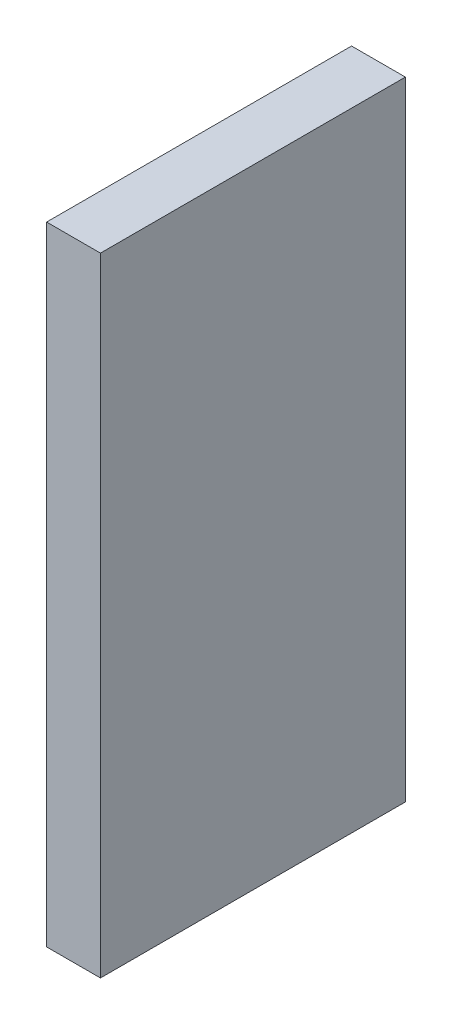
ISO-10303-21;
HEADER;
FILE_DESCRIPTION(('STEP AP214'),'2;1');
FILE_NAME('part.step','',(''),(''),'','','');
FILE_SCHEMA(('AUTOMOTIVE_DESIGN { 1 0 10303 214 1 1 1 1 }'));
ENDSEC;
DATA;
#1=APPLICATION_CONTEXT('core data for automotive mechanical design processes');
#2=APPLICATION_PROTOCOL_DEFINITION('international standard','automotive_design',2000,#1);
#3=PRODUCT_CONTEXT('',#1,'mechanical');
#4=PRODUCT('Part','Part','',(#3));
#5=PRODUCT_RELATED_PRODUCT_CATEGORY('part','',(#4));
#6=PRODUCT_DEFINITION_FORMATION('','',#4);
#7=PRODUCT_DEFINITION_CONTEXT('part definition',#1,'design');
#8=PRODUCT_DEFINITION('design','',#6,#7);
#9=PRODUCT_DEFINITION_SHAPE('','',#8);
#10=(LENGTH_UNIT() NAMED_UNIT(*) SI_UNIT(.MILLI.,.METRE.));
#11=(NAMED_UNIT(*) PLANE_ANGLE_UNIT() SI_UNIT($,.RADIAN.));
#12=(NAMED_UNIT(*) SI_UNIT($,.STERADIAN.) SOLID_ANGLE_UNIT());
#13=UNCERTAINTY_MEASURE_WITH_UNIT(LENGTH_MEASURE(1.E-05),#10,'distance_accuracy_value','');
#14=(GEOMETRIC_REPRESENTATION_CONTEXT(3) GLOBAL_UNCERTAINTY_ASSIGNED_CONTEXT((#13)) GLOBAL_UNIT_ASSIGNED_CONTEXT((#10,
#11,#12)) REPRESENTATION_CONTEXT('',''));
#15=CARTESIAN_POINT('',(0.,0.,0.));
#16=DIRECTION('',(0.,0.,1.));
#17=DIRECTION('',(1.,0.,0.));
#18=AXIS2_PLACEMENT_3D('',#15,#16,#17);
#19=CARTESIAN_POINT('',(4.77028330888016,0.,17.));
#20=DIRECTION('',(-1.,0.,0.));
#21=DIRECTION('',(0.,0.,1.));
#22=AXIS2_PLACEMENT_3D('',#19,#20,#21);
#23=PLANE('',#22);
#24=DIRECTION('',(0.,1.,0.));
#25=VECTOR('',#24,1.);
#26=CARTESIAN_POINT('',(4.77028330888016,0.,0.));
#27=LINE('',#26,#25);
#28=CARTESIAN_POINT('',(4.77028330888016,22.311583721781,0.));
#29=VERTEX_POINT('',#28);
#30=CARTESIAN_POINT('',(4.77028330888016,57.3115837217811,0.));
#31=VERTEX_POINT('',#30);
#32=EDGE_CURVE('E98',#29,#31,#27,.T.);
#33=ORIENTED_EDGE('',*,*,#32,.F.);
#34=DIRECTION('',(0.,0.,-1.));
#35=VECTOR('',#34,1.);
#36=CARTESIAN_POINT('',(4.77028330888016,22.311583721781,17.));
#37=LINE('',#36,#35);
#38=CARTESIAN_POINT('',(4.77028330888016,22.311583721781,17.));
#39=VERTEX_POINT('',#38);
#40=EDGE_CURVE('E11',#39,#29,#37,.T.);
#41=ORIENTED_EDGE('',*,*,#40,.F.);
#42=DIRECTION('',(0.,1.,0.));
#43=VECTOR('',#42,1.);
#44=CARTESIAN_POINT('',(4.77028330888016,0.,17.));
#45=LINE('',#44,#43);
#46=CARTESIAN_POINT('',(4.77028330888016,57.3115837217811,17.));
#47=VERTEX_POINT('',#46);
#48=EDGE_CURVE('E92',#39,#47,#45,.T.);
#49=ORIENTED_EDGE('',*,*,#48,.T.);
#50=DIRECTION('',(0.,0.,-1.));
#51=VECTOR('',#50,1.);
#52=CARTESIAN_POINT('',(4.77028330888016,57.3115837217811,17.));
#53=LINE('',#52,#51);
#54=EDGE_CURVE('E73',#47,#31,#53,.T.);
#55=ORIENTED_EDGE('',*,*,#54,.T.);
#56=EDGE_LOOP('',(#33,#41,#49,#55));
#57=FACE_BOUND('',#56,.T.);
#58=ADVANCED_FACE('F35',(#57),#23,.T.);
#59=CARTESIAN_POINT('',(0.,22.311583721781,17.));
#60=DIRECTION('',(0.,-1.,0.));
#61=DIRECTION('',(0.,0.,-1.));
#62=AXIS2_PLACEMENT_3D('',#59,#60,#61);
#63=PLANE('',#62);
#64=DIRECTION('',(-1.,0.,0.));
#65=VECTOR('',#64,1.);
#66=CARTESIAN_POINT('',(0.,22.311583721781,0.));
#67=LINE('',#66,#65);
#68=CARTESIAN_POINT('',(7.77028330888016,22.311583721781,0.));
#69=VERTEX_POINT('',#68);
#70=EDGE_CURVE('E86',#69,#29,#67,.T.);
#71=ORIENTED_EDGE('',*,*,#70,.F.);
#72=DIRECTION('',(0.,0.,-1.));
#73=VECTOR('',#72,1.);
#74=CARTESIAN_POINT('',(7.77028330888016,22.311583721781,17.));
#75=LINE('',#74,#73);
#76=CARTESIAN_POINT('',(7.77028330888016,22.311583721781,17.));
#77=VERTEX_POINT('',#76);
#78=EDGE_CURVE('E43',#77,#69,#75,.T.);
#79=ORIENTED_EDGE('',*,*,#78,.F.);
#80=DIRECTION('',(-1.,0.,0.));
#81=VECTOR('',#80,1.);
#82=CARTESIAN_POINT('',(0.,22.311583721781,17.));
#83=LINE('',#82,#81);
#84=EDGE_CURVE('E84',#77,#39,#83,.T.);
#85=ORIENTED_EDGE('',*,*,#84,.T.);
#86=ORIENTED_EDGE('',*,*,#40,.T.);
#87=EDGE_LOOP('',(#71,#79,#85,#86));
#88=FACE_BOUND('',#87,.T.);
#89=ADVANCED_FACE('F82',(#88),#63,.T.);
#90=CARTESIAN_POINT('',(7.77028330888017,0.,17.));
#91=DIRECTION('',(-1.,0.,0.));
#92=DIRECTION('',(0.,-1.,0.));
#93=AXIS2_PLACEMENT_3D('',#90,#91,#92);
#94=PLANE('',#93);
#95=DIRECTION('',(0.,1.,0.));
#96=VECTOR('',#95,1.);
#97=CARTESIAN_POINT('',(7.77028330888017,0.,0.));
#98=LINE('',#97,#96);
#99=CARTESIAN_POINT('',(7.77028330888016,57.3115837217811,0.));
#100=VERTEX_POINT('',#99);
#101=EDGE_CURVE('E66',#69,#100,#98,.T.);
#102=ORIENTED_EDGE('',*,*,#101,.T.);
#103=DIRECTION('',(0.,0.,-1.));
#104=VECTOR('',#103,1.);
#105=CARTESIAN_POINT('',(7.77028330888016,57.3115837217811,17.));
#106=LINE('',#105,#104);
#107=CARTESIAN_POINT('',(7.77028330888016,57.3115837217811,17.));
#108=VERTEX_POINT('',#107);
#109=EDGE_CURVE('E87',#108,#100,#106,.T.);
#110=ORIENTED_EDGE('',*,*,#109,.F.);
#111=DIRECTION('',(0.,1.,0.));
#112=VECTOR('',#111,1.);
#113=CARTESIAN_POINT('',(7.77028330888017,0.,17.));
#114=LINE('',#113,#112);
#115=EDGE_CURVE('E88',#77,#108,#114,.T.);
#116=ORIENTED_EDGE('',*,*,#115,.F.);
#117=ORIENTED_EDGE('',*,*,#78,.T.);
#118=EDGE_LOOP('',(#102,#110,#116,#117));
#119=FACE_BOUND('',#118,.T.);
#120=ADVANCED_FACE('F89',(#119),#94,.F.);
#121=CARTESIAN_POINT('',(0.,57.3115837217811,17.));
#122=DIRECTION('',(0.,-1.,0.));
#123=DIRECTION('',(0.,0.,-1.));
#124=AXIS2_PLACEMENT_3D('',#121,#122,#123);
#125=PLANE('',#124);
#126=DIRECTION('',(-1.,0.,0.));
#127=VECTOR('',#126,1.);
#128=CARTESIAN_POINT('',(0.,57.3115837217811,0.));
#129=LINE('',#128,#127);
#130=EDGE_CURVE('E94',#100,#31,#129,.T.);
#131=ORIENTED_EDGE('',*,*,#130,.T.);
#132=ORIENTED_EDGE('',*,*,#54,.F.);
#133=DIRECTION('',(-1.,0.,0.));
#134=VECTOR('',#133,1.);
#135=CARTESIAN_POINT('',(0.,57.3115837217811,17.));
#136=LINE('',#135,#134);
#137=EDGE_CURVE('E51',#108,#47,#136,.T.);
#138=ORIENTED_EDGE('',*,*,#137,.F.);
#139=ORIENTED_EDGE('',*,*,#109,.T.);
#140=EDGE_LOOP('',(#131,#132,#138,#139));
#141=FACE_BOUND('',#140,.T.);
#142=ADVANCED_FACE('F107',(#141),#125,.F.);
#143=CARTESIAN_POINT('',(0.,0.,17.));
#144=DIRECTION('',(0.,0.,1.));
#145=DIRECTION('',(1.,0.,0.));
#146=AXIS2_PLACEMENT_3D('',#143,#144,#145);
#147=PLANE('',#146);
#148=ORIENTED_EDGE('',*,*,#48,.F.);
#149=ORIENTED_EDGE('',*,*,#84,.F.);
#150=ORIENTED_EDGE('',*,*,#115,.T.);
#151=ORIENTED_EDGE('',*,*,#137,.T.);
#152=EDGE_LOOP('',(#148,#149,#150,#151));
#153=FACE_BOUND('',#152,.T.);
#154=ADVANCED_FACE('F91',(#153),#147,.T.);
#155=CARTESIAN_POINT('',(0.,0.,0.));
#156=DIRECTION('',(0.,0.,1.));
#157=DIRECTION('',(1.,0.,0.));
#158=AXIS2_PLACEMENT_3D('',#155,#156,#157);
#159=PLANE('',#158);
#160=ORIENTED_EDGE('',*,*,#32,.T.);
#161=ORIENTED_EDGE('',*,*,#130,.F.);
#162=ORIENTED_EDGE('',*,*,#101,.F.);
#163=ORIENTED_EDGE('',*,*,#70,.T.);
#164=EDGE_LOOP('',(#160,#161,#162,#163));
#165=FACE_BOUND('',#164,.T.);
#166=ADVANCED_FACE('F109',(#165),#159,.F.);
#167=CLOSED_SHELL('',(#58,#89,#120,#142,#154,#166));
#168=MANIFOLD_SOLID_BREP('B2',#167);
#169=ADVANCED_BREP_SHAPE_REPRESENTATION('',(#18,#168),#14);
#170=SHAPE_DEFINITION_REPRESENTATION(#9,#169);
ENDSEC;
END-ISO-10303-21;
